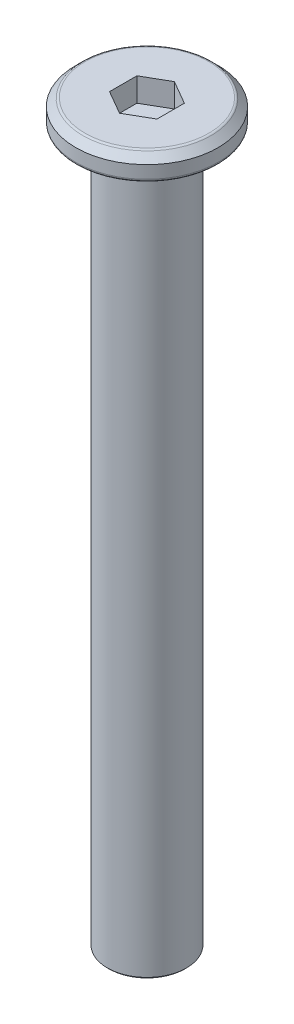
ISO-10303-21;
HEADER;
FILE_DESCRIPTION(('STEP AP214'),'2;1');
FILE_NAME('part.step','',(''),(''),'','','');
FILE_SCHEMA(('AUTOMOTIVE_DESIGN { 1 0 10303 214 1 1 1 1 }'));
ENDSEC;
DATA;
#1=APPLICATION_CONTEXT('core data for automotive mechanical design processes');
#2=APPLICATION_PROTOCOL_DEFINITION('international standard','automotive_design',2000,#1);
#3=PRODUCT_CONTEXT('',#1,'mechanical');
#4=PRODUCT('Part','Part','',(#3));
#5=PRODUCT_RELATED_PRODUCT_CATEGORY('part','',(#4));
#6=PRODUCT_DEFINITION_FORMATION('','',#4);
#7=PRODUCT_DEFINITION_CONTEXT('part definition',#1,'design');
#8=PRODUCT_DEFINITION('design','',#6,#7);
#9=PRODUCT_DEFINITION_SHAPE('','',#8);
#10=(LENGTH_UNIT() NAMED_UNIT(*) SI_UNIT(.MILLI.,.METRE.));
#11=(NAMED_UNIT(*) PLANE_ANGLE_UNIT() SI_UNIT($,.RADIAN.));
#12=(NAMED_UNIT(*) SI_UNIT($,.STERADIAN.) SOLID_ANGLE_UNIT());
#13=UNCERTAINTY_MEASURE_WITH_UNIT(LENGTH_MEASURE(1.E-05),#10,'distance_accuracy_value','');
#14=(GEOMETRIC_REPRESENTATION_CONTEXT(3) GLOBAL_UNCERTAINTY_ASSIGNED_CONTEXT((#13)) GLOBAL_UNIT_ASSIGNED_CONTEXT((#10,
#11,#12)) REPRESENTATION_CONTEXT('',''));
#15=CARTESIAN_POINT('',(0.,0.,0.));
#16=DIRECTION('',(0.,0.,1.));
#17=DIRECTION('',(1.,0.,0.));
#18=AXIS2_PLACEMENT_3D('',#15,#16,#17);
#19=CARTESIAN_POINT('',(1.16184979486889,23.2499999998863,-1.16184979520995));
#20=DIRECTION('',(0.,-1.,0.));
#21=DIRECTION('',(0.,0.,-1.));
#22=AXIS2_PLACEMENT_3D('',#19,#20,#21);
#23=CYLINDRICAL_SURFACE('',#22,4.5);
#24=CARTESIAN_POINT('',(1.16184979486889,21.9499999998863,-1.16184979520995));
#25=DIRECTION('',(0.,1.,0.));
#26=DIRECTION('',(0.,0.,1.));
#27=AXIS2_PLACEMENT_3D('',#24,#25,#26);
#28=CIRCLE('',#27,4.5);
#29=CARTESIAN_POINT('',(1.16184979486889,21.9499999998863,3.33815020479005));
#30=VERTEX_POINT('',#29);
#31=EDGE_CURVE('E130',#30,#30,#28,.T.);
#32=ORIENTED_EDGE('',*,*,#31,.T.);
#33=EDGE_LOOP('',(#32));
#34=FACE_BOUND('',#33,.T.);
#35=CARTESIAN_POINT('',(1.16184979486889,22.7499999998863,-1.16184979520995));
#36=DIRECTION('',(0.,1.,0.));
#37=DIRECTION('',(0.,0.,1.));
#38=AXIS2_PLACEMENT_3D('',#35,#36,#37);
#39=CIRCLE('',#38,4.5);
#40=CARTESIAN_POINT('',(1.16184979486889,22.7499999998863,3.33815020479005));
#41=VERTEX_POINT('',#40);
#42=EDGE_CURVE('E116',#41,#41,#39,.F.);
#43=ORIENTED_EDGE('',*,*,#42,.T.);
#44=EDGE_LOOP('',(#43));
#45=FACE_BOUND('',#44,.T.);
#46=ADVANCED_FACE('F16',(#34,#45),#23,.T.);
#47=CARTESIAN_POINT('',(1.16184979486889,23.2499999998863,-1.16184979520995));
#48=DIRECTION('',(0.,1.,0.));
#49=DIRECTION('',(0.,0.,1.));
#50=AXIS2_PLACEMENT_3D('',#47,#48,#49);
#51=PLANE('',#50);
#52=DIRECTION('',(-0.866025403784439,0.,-0.5));
#53=VECTOR('',#52,1.);
#54=CARTESIAN_POINT('',(2.66184979486889,23.2499999998863,-2.02787519899439));
#55=LINE('',#54,#53);
#56=CARTESIAN_POINT('',(2.66184979486889,23.2499999998863,-2.02787519899439));
#57=VERTEX_POINT('',#56);
#58=CARTESIAN_POINT('',(1.16184979486889,23.2499999998863,-2.89390060277882));
#59=VERTEX_POINT('',#58);
#60=EDGE_CURVE('E31',#57,#59,#55,.T.);
#61=ORIENTED_EDGE('',*,*,#60,.F.);
#62=DIRECTION('',(0.,0.,-1.));
#63=VECTOR('',#62,1.);
#64=CARTESIAN_POINT('',(2.66184979486889,23.2499999998863,-0.295824391425507));
#65=LINE('',#64,#63);
#66=CARTESIAN_POINT('',(2.66184979486889,23.2499999998863,-0.295824391425507));
#67=VERTEX_POINT('',#66);
#68=EDGE_CURVE('E112',#67,#57,#65,.T.);
#69=ORIENTED_EDGE('',*,*,#68,.F.);
#70=DIRECTION('',(0.866025403784439,0.,-0.5));
#71=VECTOR('',#70,1.);
#72=CARTESIAN_POINT('',(1.16184979486889,23.2499999998863,0.570201012358931));
#73=LINE('',#72,#71);
#74=CARTESIAN_POINT('',(1.16184979486889,23.2499999998863,0.570201012358931));
#75=VERTEX_POINT('',#74);
#76=EDGE_CURVE('E110',#75,#67,#73,.T.);
#77=ORIENTED_EDGE('',*,*,#76,.F.);
#78=DIRECTION('',(0.866025403784438,0.,0.5));
#79=VECTOR('',#78,1.);
#80=CARTESIAN_POINT('',(-0.338150205131115,23.2499999998863,-0.295824391425507));
#81=LINE('',#80,#79);
#82=CARTESIAN_POINT('',(-0.338150205131115,23.2499999998863,-0.295824391425507));
#83=VERTEX_POINT('',#82);
#84=EDGE_CURVE('E78',#83,#75,#81,.T.);
#85=ORIENTED_EDGE('',*,*,#84,.F.);
#86=DIRECTION('',(0.,0.,1.));
#87=VECTOR('',#86,1.);
#88=CARTESIAN_POINT('',(-0.338150205131115,23.2499999998863,-2.02787519899439));
#89=LINE('',#88,#87);
#90=CARTESIAN_POINT('',(-0.338150205131115,23.2499999998863,-2.02787519899439));
#91=VERTEX_POINT('',#90);
#92=EDGE_CURVE('E106',#91,#83,#89,.T.);
#93=ORIENTED_EDGE('',*,*,#92,.F.);
#94=DIRECTION('',(-0.866025403784439,0.,0.5));
#95=VECTOR('',#94,1.);
#96=CARTESIAN_POINT('',(1.16184979486889,23.2499999998863,-2.89390060277882));
#97=LINE('',#96,#95);
#98=EDGE_CURVE('E103',#59,#91,#97,.T.);
#99=ORIENTED_EDGE('',*,*,#98,.F.);
#100=EDGE_LOOP('',(#61,#69,#77,#85,#93,#99));
#101=FACE_BOUND('',#100,.T.);
#102=CARTESIAN_POINT('',(1.16184979486889,23.2499999998863,-1.16184979520995));
#103=DIRECTION('',(0.,1.,0.));
#104=DIRECTION('',(0.,0.,1.));
#105=AXIS2_PLACEMENT_3D('',#102,#103,#104);
#106=CIRCLE('',#105,3.91715728752538);
#107=CARTESIAN_POINT('',(1.16184979486889,23.2499999998863,2.75530749231543));
#108=VERTEX_POINT('',#107);
#109=EDGE_CURVE('E124',#108,#108,#106,.T.);
#110=ORIENTED_EDGE('',*,*,#109,.T.);
#111=EDGE_LOOP('',(#110));
#112=FACE_BOUND('',#111,.T.);
#113=ADVANCED_FACE('F156',(#101,#112),#51,.T.);
#114=CARTESIAN_POINT('',(1.16184979486889,21.7499999998863,-1.16184979520995));
#115=DIRECTION('',(0.,1.,0.));
#116=DIRECTION('',(0.,0.,1.));
#117=AXIS2_PLACEMENT_3D('',#114,#115,#116);
#118=PLANE('',#117);
#119=CARTESIAN_POINT('',(1.16184979486889,21.7499999998863,-1.16184979520995));
#120=DIRECTION('',(0.,1.,0.));
#121=DIRECTION('',(0.,0.,1.));
#122=AXIS2_PLACEMENT_3D('',#119,#120,#121);
#123=CIRCLE('',#122,2.75);
#124=CARTESIAN_POINT('',(1.16184979486889,21.7499999998863,1.58815020479005));
#125=VERTEX_POINT('',#124);
#126=EDGE_CURVE('E139',#125,#125,#123,.T.);
#127=ORIENTED_EDGE('',*,*,#126,.T.);
#128=EDGE_LOOP('',(#127));
#129=FACE_BOUND('',#128,.T.);
#130=CARTESIAN_POINT('',(1.16184979486889,21.7499999998863,-1.16184979520995));
#131=DIRECTION('',(0.,1.,0.));
#132=DIRECTION('',(0.,0.,1.));
#133=AXIS2_PLACEMENT_3D('',#130,#131,#132);
#134=CIRCLE('',#133,4.3);
#135=CARTESIAN_POINT('',(1.16184979486889,21.7499999998863,3.13815020479005));
#136=VERTEX_POINT('',#135);
#137=EDGE_CURVE('E133',#136,#136,#134,.F.);
#138=ORIENTED_EDGE('',*,*,#137,.T.);
#139=EDGE_LOOP('',(#138));
#140=FACE_BOUND('',#139,.T.);
#141=ADVANCED_FACE('F162',(#129,#140),#118,.F.);
#142=CARTESIAN_POINT('',(1.16184979486889,23.2499999998863,-1.16184979520995));
#143=DIRECTION('',(0.,-1.,0.));
#144=DIRECTION('',(0.,0.,-1.));
#145=AXIS2_PLACEMENT_3D('',#142,#143,#144);
#146=CONICAL_SURFACE('',#145,4.,0.785398163397447);
#147=CARTESIAN_POINT('',(1.16184979486889,23.1914213561236,-1.16184979520995));
#148=DIRECTION('',(0.,1.,0.));
#149=DIRECTION('',(0.,0.,1.));
#150=AXIS2_PLACEMENT_3D('',#147,#148,#149);
#151=CIRCLE('',#150,4.05857864376269);
#152=CARTESIAN_POINT('',(1.16184979486889,23.1914213561236,2.89672884855274));
#153=VERTEX_POINT('',#152);
#154=EDGE_CURVE('E127',#153,#153,#151,.F.);
#155=ORIENTED_EDGE('',*,*,#154,.T.);
#156=EDGE_LOOP('',(#155));
#157=FACE_BOUND('',#156,.T.);
#158=ORIENTED_EDGE('',*,*,#42,.F.);
#159=EDGE_LOOP('',(#158));
#160=FACE_BOUND('',#159,.T.);
#161=ADVANCED_FACE('F168',(#157,#160),#146,.T.);
#162=CARTESIAN_POINT('',(1.16184979486889,23.0499999998863,-1.16184979520995));
#163=DIRECTION('',(0.,1.,0.));
#164=DIRECTION('',(0.,0.,1.));
#165=AXIS2_PLACEMENT_3D('',#162,#163,#164);
#166=TOROIDAL_SURFACE('',#165,3.91715728752538,0.2);
#167=ORIENTED_EDGE('',*,*,#154,.F.);
#168=EDGE_LOOP('',(#167));
#169=FACE_BOUND('',#168,.T.);
#170=ORIENTED_EDGE('',*,*,#109,.F.);
#171=EDGE_LOOP('',(#170));
#172=FACE_BOUND('',#171,.T.);
#173=ADVANCED_FACE('F171',(#169,#172),#166,.T.);
#174=CARTESIAN_POINT('',(1.16184979486889,21.9499999998863,-1.16184979520995));
#175=DIRECTION('',(0.,1.,0.));
#176=DIRECTION('',(0.,0.,1.));
#177=AXIS2_PLACEMENT_3D('',#174,#175,#176);
#178=TOROIDAL_SURFACE('',#177,4.3,0.2);
#179=ORIENTED_EDGE('',*,*,#137,.F.);
#180=EDGE_LOOP('',(#179));
#181=FACE_BOUND('',#180,.T.);
#182=ORIENTED_EDGE('',*,*,#31,.F.);
#183=EDGE_LOOP('',(#182));
#184=FACE_BOUND('',#183,.T.);
#185=ADVANCED_FACE('F175',(#181,#184),#178,.T.);
#186=CARTESIAN_POINT('',(2.66184979486889,21.7499999998863,-2.02787519899439));
#187=DIRECTION('',(0.5,0.,-0.866025403784438));
#188=DIRECTION('',(-0.866025403784439,0.,-0.5));
#189=AXIS2_PLACEMENT_3D('',#186,#187,#188);
#190=PLANE('',#189);
#191=ORIENTED_EDGE('',*,*,#60,.T.);
#192=DIRECTION('',(0.,1.,0.));
#193=VECTOR('',#192,1.);
#194=CARTESIAN_POINT('',(1.16184979486889,21.7499999998863,-2.89390060277882));
#195=LINE('',#194,#193);
#196=CARTESIAN_POINT('',(1.16184979486889,21.7499999998863,-2.89390060277882));
#197=VERTEX_POINT('',#196);
#198=EDGE_CURVE('E62',#197,#59,#195,.T.);
#199=ORIENTED_EDGE('',*,*,#198,.F.);
#200=DIRECTION('',(-0.866025403784439,0.,-0.5));
#201=VECTOR('',#200,1.);
#202=CARTESIAN_POINT('',(2.66184979486889,21.7499999998863,-2.02787519899439));
#203=LINE('',#202,#201);
#204=CARTESIAN_POINT('',(2.66184979486889,21.7499999998863,-2.02787519899439));
#205=VERTEX_POINT('',#204);
#206=EDGE_CURVE('E114',#205,#197,#203,.T.);
#207=ORIENTED_EDGE('',*,*,#206,.F.);
#208=DIRECTION('',(0.,1.,0.));
#209=VECTOR('',#208,1.);
#210=CARTESIAN_POINT('',(2.66184979486889,21.7499999998863,-2.02787519899439));
#211=LINE('',#210,#209);
#212=EDGE_CURVE('E39',#205,#57,#211,.T.);
#213=ORIENTED_EDGE('',*,*,#212,.T.);
#214=EDGE_LOOP('',(#191,#199,#207,#213));
#215=FACE_BOUND('',#214,.T.);
#216=ADVANCED_FACE('F178',(#215),#190,.F.);
#217=CARTESIAN_POINT('',(2.66184979486889,21.7499999998863,-0.295824391425507));
#218=DIRECTION('',(1.,0.,0.));
#219=DIRECTION('',(0.,0.,-1.));
#220=AXIS2_PLACEMENT_3D('',#217,#218,#219);
#221=PLANE('',#220);
#222=ORIENTED_EDGE('',*,*,#68,.T.);
#223=ORIENTED_EDGE('',*,*,#212,.F.);
#224=DIRECTION('',(0.,0.,-1.));
#225=VECTOR('',#224,1.);
#226=CARTESIAN_POINT('',(2.66184979486889,21.7499999998863,-0.295824391425507));
#227=LINE('',#226,#225);
#228=CARTESIAN_POINT('',(2.66184979486889,21.7499999998863,-0.295824391425507));
#229=VERTEX_POINT('',#228);
#230=EDGE_CURVE('E90',#229,#205,#227,.T.);
#231=ORIENTED_EDGE('',*,*,#230,.F.);
#232=DIRECTION('',(0.,1.,0.));
#233=VECTOR('',#232,1.);
#234=CARTESIAN_POINT('',(2.66184979486889,21.7499999998863,-0.295824391425507));
#235=LINE('',#234,#233);
#236=EDGE_CURVE('E82',#229,#67,#235,.T.);
#237=ORIENTED_EDGE('',*,*,#236,.T.);
#238=EDGE_LOOP('',(#222,#223,#231,#237));
#239=FACE_BOUND('',#238,.T.);
#240=ADVANCED_FACE('F183',(#239),#221,.F.);
#241=CARTESIAN_POINT('',(1.16184979486889,21.7499999998863,0.570201012358931));
#242=DIRECTION('',(0.5,0.,0.866025403784439));
#243=DIRECTION('',(0.866025403784439,0.,-0.5));
#244=AXIS2_PLACEMENT_3D('',#241,#242,#243);
#245=PLANE('',#244);
#246=ORIENTED_EDGE('',*,*,#76,.T.);
#247=ORIENTED_EDGE('',*,*,#236,.F.);
#248=DIRECTION('',(0.866025403784439,0.,-0.5));
#249=VECTOR('',#248,1.);
#250=CARTESIAN_POINT('',(1.16184979486889,21.7499999998863,0.570201012358931));
#251=LINE('',#250,#249);
#252=CARTESIAN_POINT('',(1.16184979486889,21.7499999998863,0.570201012358931));
#253=VERTEX_POINT('',#252);
#254=EDGE_CURVE('E86',#253,#229,#251,.T.);
#255=ORIENTED_EDGE('',*,*,#254,.F.);
#256=DIRECTION('',(0.,1.,0.));
#257=VECTOR('',#256,1.);
#258=CARTESIAN_POINT('',(1.16184979486889,21.7499999998863,0.570201012358931));
#259=LINE('',#258,#257);
#260=EDGE_CURVE('E71',#253,#75,#259,.T.);
#261=ORIENTED_EDGE('',*,*,#260,.T.);
#262=EDGE_LOOP('',(#246,#247,#255,#261));
#263=FACE_BOUND('',#262,.T.);
#264=ADVANCED_FACE('F87',(#263),#245,.F.);
#265=CARTESIAN_POINT('',(-0.338150205131115,21.7499999998863,-0.295824391425507));
#266=DIRECTION('',(-0.5,0.,0.866025403784439));
#267=DIRECTION('',(0.866025403784439,0.,0.5));
#268=AXIS2_PLACEMENT_3D('',#265,#266,#267);
#269=PLANE('',#268);
#270=ORIENTED_EDGE('',*,*,#84,.T.);
#271=ORIENTED_EDGE('',*,*,#260,.F.);
#272=DIRECTION('',(0.866025403784438,0.,0.5));
#273=VECTOR('',#272,1.);
#274=CARTESIAN_POINT('',(-0.338150205131115,21.7499999998863,-0.295824391425507));
#275=LINE('',#274,#273);
#276=CARTESIAN_POINT('',(-0.338150205131115,21.7499999998863,-0.295824391425507));
#277=VERTEX_POINT('',#276);
#278=EDGE_CURVE('E75',#277,#253,#275,.T.);
#279=ORIENTED_EDGE('',*,*,#278,.F.);
#280=DIRECTION('',(0.,1.,0.));
#281=VECTOR('',#280,1.);
#282=CARTESIAN_POINT('',(-0.338150205131115,21.7499999998863,-0.295824391425507));
#283=LINE('',#282,#281);
#284=EDGE_CURVE('E83',#277,#83,#283,.T.);
#285=ORIENTED_EDGE('',*,*,#284,.T.);
#286=EDGE_LOOP('',(#270,#271,#279,#285));
#287=FACE_BOUND('',#286,.T.);
#288=ADVANCED_FACE('F73',(#287),#269,.F.);
#289=CARTESIAN_POINT('',(-0.338150205131115,21.7499999998863,-2.02787519899439));
#290=DIRECTION('',(-1.,0.,0.));
#291=DIRECTION('',(0.,0.,1.));
#292=AXIS2_PLACEMENT_3D('',#289,#290,#291);
#293=PLANE('',#292);
#294=ORIENTED_EDGE('',*,*,#92,.T.);
#295=ORIENTED_EDGE('',*,*,#284,.F.);
#296=DIRECTION('',(0.,0.,1.));
#297=VECTOR('',#296,1.);
#298=CARTESIAN_POINT('',(-0.338150205131115,21.7499999998863,-2.02787519899439));
#299=LINE('',#298,#297);
#300=CARTESIAN_POINT('',(-0.338150205131114,21.7499999998863,-2.02787519899439));
#301=VERTEX_POINT('',#300);
#302=EDGE_CURVE('E95',#301,#277,#299,.T.);
#303=ORIENTED_EDGE('',*,*,#302,.F.);
#304=DIRECTION('',(0.,1.,0.));
#305=VECTOR('',#304,1.);
#306=CARTESIAN_POINT('',(-0.338150205131115,21.7499999998863,-2.02787519899439));
#307=LINE('',#306,#305);
#308=EDGE_CURVE('E119',#301,#91,#307,.T.);
#309=ORIENTED_EDGE('',*,*,#308,.T.);
#310=EDGE_LOOP('',(#294,#295,#303,#309));
#311=FACE_BOUND('',#310,.T.);
#312=ADVANCED_FACE('F215',(#311),#293,.F.);
#313=CARTESIAN_POINT('',(1.16184979486889,21.7499999998863,-2.89390060277882));
#314=DIRECTION('',(-0.5,0.,-0.866025403784439));
#315=DIRECTION('',(-0.866025403784439,0.,0.5));
#316=AXIS2_PLACEMENT_3D('',#313,#314,#315);
#317=PLANE('',#316);
#318=ORIENTED_EDGE('',*,*,#98,.T.);
#319=ORIENTED_EDGE('',*,*,#308,.F.);
#320=DIRECTION('',(-0.866025403784439,0.,0.5));
#321=VECTOR('',#320,1.);
#322=CARTESIAN_POINT('',(1.16184979486889,21.7499999998863,-2.89390060277882));
#323=LINE('',#322,#321);
#324=EDGE_CURVE('E97',#197,#301,#323,.T.);
#325=ORIENTED_EDGE('',*,*,#324,.F.);
#326=ORIENTED_EDGE('',*,*,#198,.T.);
#327=EDGE_LOOP('',(#318,#319,#325,#326));
#328=FACE_BOUND('',#327,.T.);
#329=ADVANCED_FACE('F206',(#328),#317,.F.);
#330=CARTESIAN_POINT('',(1.16184979486889,21.7499999998863,-1.16184979520995));
#331=DIRECTION('',(0.,-1.,0.));
#332=DIRECTION('',(0.,0.,-1.));
#333=AXIS2_PLACEMENT_3D('',#330,#331,#332);
#334=PLANE('',#333);
#335=ORIENTED_EDGE('',*,*,#230,.T.);
#336=ORIENTED_EDGE('',*,*,#206,.T.);
#337=ORIENTED_EDGE('',*,*,#324,.T.);
#338=ORIENTED_EDGE('',*,*,#302,.T.);
#339=ORIENTED_EDGE('',*,*,#278,.T.);
#340=ORIENTED_EDGE('',*,*,#254,.T.);
#341=EDGE_LOOP('',(#335,#336,#337,#338,#339,#340));
#342=FACE_BOUND('',#341,.T.);
#343=ADVANCED_FACE('F92',(#342),#334,.F.);
#344=CARTESIAN_POINT('',(1.16184979486889,-23.2500000001137,-1.16184979520995));
#345=DIRECTION('',(0.,1.,0.));
#346=DIRECTION('',(0.,0.,1.));
#347=AXIS2_PLACEMENT_3D('',#344,#345,#346);
#348=CYLINDRICAL_SURFACE('',#347,2.5);
#349=CARTESIAN_POINT('',(1.16184979486889,-23.1500000001137,-1.16184979520995));
#350=DIRECTION('',(0.,-1.,0.));
#351=DIRECTION('',(0.,0.,-1.));
#352=AXIS2_PLACEMENT_3D('',#349,#350,#351);
#353=CIRCLE('',#352,2.5);
#354=CARTESIAN_POINT('',(1.16184979486889,-23.1500000001137,-3.66184979520995));
#355=VERTEX_POINT('',#354);
#356=EDGE_CURVE('E10',#355,#355,#353,.F.);
#357=ORIENTED_EDGE('',*,*,#356,.T.);
#358=EDGE_LOOP('',(#357));
#359=FACE_BOUND('',#358,.T.);
#360=CARTESIAN_POINT('',(1.16184979486889,21.4999999998863,-1.16184979520995));
#361=DIRECTION('',(0.,1.,0.));
#362=DIRECTION('',(0.,0.,1.));
#363=AXIS2_PLACEMENT_3D('',#360,#361,#362);
#364=CIRCLE('',#363,2.5);
#365=CARTESIAN_POINT('',(1.16184979486889,21.4999999998863,1.33815020479005));
#366=VERTEX_POINT('',#365);
#367=EDGE_CURVE('E136',#366,#366,#364,.F.);
#368=ORIENTED_EDGE('',*,*,#367,.T.);
#369=EDGE_LOOP('',(#368));
#370=FACE_BOUND('',#369,.T.);
#371=ADVANCED_FACE('F197',(#359,#370),#348,.T.);
#372=CARTESIAN_POINT('',(1.16184979486889,-23.2500000001137,-1.16184979520995));
#373=DIRECTION('',(0.,-1.,0.));
#374=DIRECTION('',(0.,0.,-1.));
#375=AXIS2_PLACEMENT_3D('',#372,#373,#374);
#376=PLANE('',#375);
#377=CARTESIAN_POINT('',(1.16184979486889,-23.2500000001137,-1.16184979520995));
#378=DIRECTION('',(0.,-1.,0.));
#379=DIRECTION('',(0.,0.,-1.));
#380=AXIS2_PLACEMENT_3D('',#377,#378,#379);
#381=CIRCLE('',#380,2.40000000000002);
#382=CARTESIAN_POINT('',(1.16184979486889,-23.2500000001137,-3.56184979520997));
#383=VERTEX_POINT('',#382);
#384=EDGE_CURVE('E24',#383,#383,#381,.T.);
#385=ORIENTED_EDGE('',*,*,#384,.T.);
#386=EDGE_LOOP('',(#385));
#387=FACE_BOUND('',#386,.T.);
#388=ADVANCED_FACE('F144',(#387),#376,.T.);
#389=CARTESIAN_POINT('',(1.16184979486889,21.4999999998863,-1.16184979520995));
#390=DIRECTION('',(0.,1.,0.));
#391=DIRECTION('',(0.,0.,1.));
#392=AXIS2_PLACEMENT_3D('',#389,#390,#391);
#393=TOROIDAL_SURFACE('',#392,2.75,0.25);
#394=ORIENTED_EDGE('',*,*,#126,.F.);
#395=EDGE_LOOP('',(#394));
#396=FACE_BOUND('',#395,.T.);
#397=ORIENTED_EDGE('',*,*,#367,.F.);
#398=EDGE_LOOP('',(#397));
#399=FACE_BOUND('',#398,.T.);
#400=ADVANCED_FACE('F147',(#396,#399),#393,.F.);
#401=CARTESIAN_POINT('',(1.16184979486889,-23.2500000001137,-1.16184979520995));
#402=DIRECTION('',(0.,1.,0.));
#403=DIRECTION('',(0.,0.,1.));
#404=AXIS2_PLACEMENT_3D('',#401,#402,#403);
#405=CONICAL_SURFACE('',#404,2.40000000000002,0.78539816339744);
#406=ORIENTED_EDGE('',*,*,#356,.F.);
#407=EDGE_LOOP('',(#406));
#408=FACE_BOUND('',#407,.T.);
#409=ORIENTED_EDGE('',*,*,#384,.F.);
#410=EDGE_LOOP('',(#409));
#411=FACE_BOUND('',#410,.T.);
#412=ADVANCED_FACE('F18',(#408,#411),#405,.T.);
#413=CLOSED_SHELL('',(#46,#113,#141,#161,#173,#185,#216,#240,#264,#288,#312,#329,#343,#371,#388,
#400,#412));
#414=MANIFOLD_SOLID_BREP('B1',#413);
#415=ADVANCED_BREP_SHAPE_REPRESENTATION('',(#18,#414),#14);
#416=SHAPE_DEFINITION_REPRESENTATION(#9,#415);
ENDSEC;
END-ISO-10303-21;
